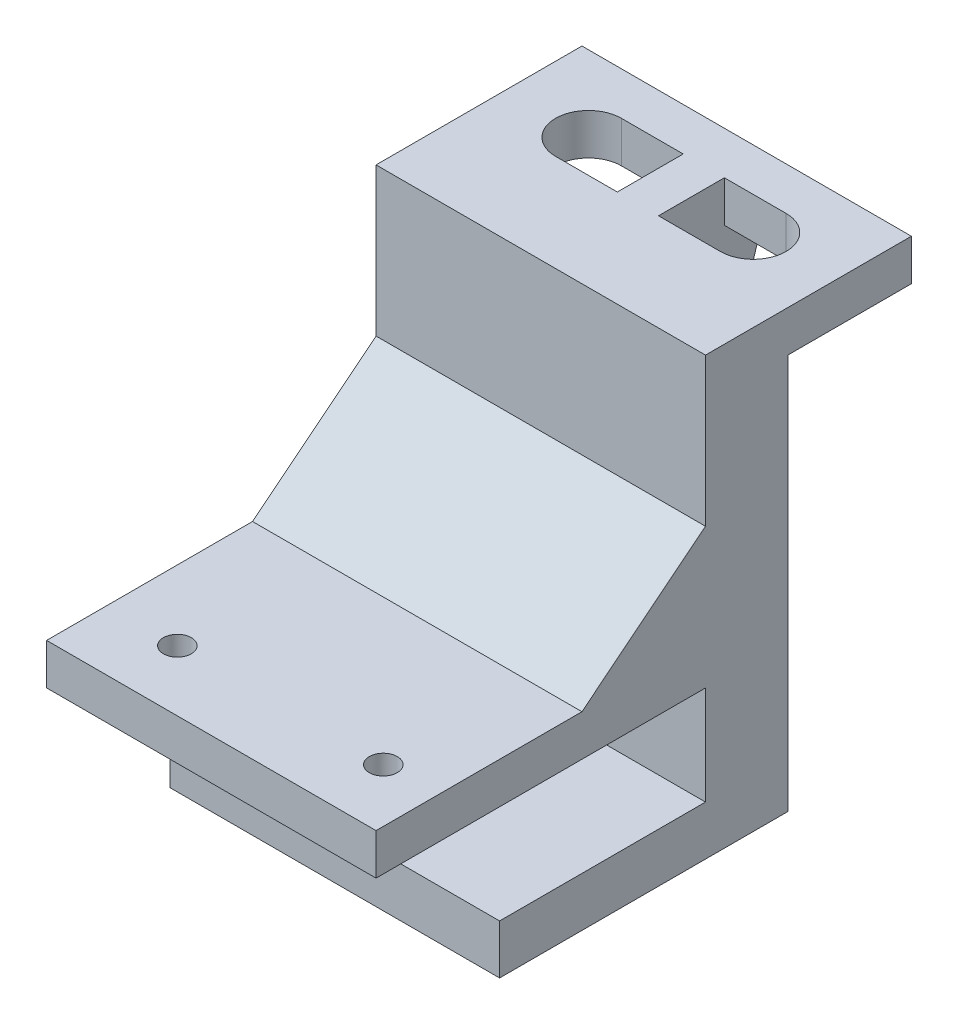
ISO-10303-21;
HEADER;
FILE_DESCRIPTION(('STEP AP214'),'2;1');
FILE_NAME('part.step','',(''),(''),'','','');
FILE_SCHEMA(('AUTOMOTIVE_DESIGN { 1 0 10303 214 1 1 1 1 }'));
ENDSEC;
DATA;
#1=APPLICATION_CONTEXT('core data for automotive mechanical design processes');
#2=APPLICATION_PROTOCOL_DEFINITION('international standard','automotive_design',2000,#1);
#3=PRODUCT_CONTEXT('',#1,'mechanical');
#4=PRODUCT('Part','Part','',(#3));
#5=PRODUCT_RELATED_PRODUCT_CATEGORY('part','',(#4));
#6=PRODUCT_DEFINITION_FORMATION('','',#4);
#7=PRODUCT_DEFINITION_CONTEXT('part definition',#1,'design');
#8=PRODUCT_DEFINITION('design','',#6,#7);
#9=PRODUCT_DEFINITION_SHAPE('','',#8);
#10=(LENGTH_UNIT() NAMED_UNIT(*) SI_UNIT(.MILLI.,.METRE.));
#11=(NAMED_UNIT(*) PLANE_ANGLE_UNIT() SI_UNIT($,.RADIAN.));
#12=(NAMED_UNIT(*) SI_UNIT($,.STERADIAN.) SOLID_ANGLE_UNIT());
#13=UNCERTAINTY_MEASURE_WITH_UNIT(LENGTH_MEASURE(1.E-05),#10,'distance_accuracy_value','');
#14=(GEOMETRIC_REPRESENTATION_CONTEXT(3) GLOBAL_UNCERTAINTY_ASSIGNED_CONTEXT((#13)) GLOBAL_UNIT_ASSIGNED_CONTEXT((#10,
#11,#12)) REPRESENTATION_CONTEXT('',''));
#15=CARTESIAN_POINT('',(0.,0.,0.));
#16=DIRECTION('',(0.,0.,1.));
#17=DIRECTION('',(1.,0.,0.));
#18=AXIS2_PLACEMENT_3D('',#15,#16,#17);
#19=CARTESIAN_POINT('',(-11.5,-10.,37.6238003373146));
#20=DIRECTION('',(0.,-1.,0.));
#21=DIRECTION('',(0.,0.,-1.));
#22=AXIS2_PLACEMENT_3D('',#19,#20,#21);
#23=CYLINDRICAL_SURFACE('',#22,1.7);
#24=CARTESIAN_POINT('',(-11.5,-30.,37.6238003373146));
#25=DIRECTION('',(0.,-1.,0.));
#26=DIRECTION('',(0.,0.,-1.));
#27=AXIS2_PLACEMENT_3D('',#24,#25,#26);
#28=CIRCLE('',#27,1.7);
#29=CARTESIAN_POINT('',(-11.5,-30.,35.9238003373146));
#30=VERTEX_POINT('',#29);
#31=EDGE_CURVE('E44',#30,#30,#28,.T.);
#32=ORIENTED_EDGE('',*,*,#31,.F.);
#33=EDGE_LOOP('',(#32));
#34=FACE_BOUND('',#33,.T.);
#35=CARTESIAN_POINT('',(-11.5,-35.,37.6238003373146));
#36=DIRECTION('',(0.,-1.,0.));
#37=DIRECTION('',(0.,0.,-1.));
#38=AXIS2_PLACEMENT_3D('',#35,#36,#37);
#39=CIRCLE('',#38,1.7);
#40=CARTESIAN_POINT('',(-11.5,-35.,35.9238003373146));
#41=VERTEX_POINT('',#40);
#42=EDGE_CURVE('E124',#41,#41,#39,.T.);
#43=ORIENTED_EDGE('',*,*,#42,.T.);
#44=EDGE_LOOP('',(#43));
#45=FACE_BOUND('',#44,.T.);
#46=ADVANCED_FACE('F16',(#34,#45),#23,.F.);
#47=CARTESIAN_POINT('',(13.5,-10.,37.6238003373146));
#48=DIRECTION('',(0.,-1.,0.));
#49=DIRECTION('',(0.,0.,-1.));
#50=AXIS2_PLACEMENT_3D('',#47,#48,#49);
#51=CYLINDRICAL_SURFACE('',#50,1.7);
#52=CARTESIAN_POINT('',(13.5,-30.,37.6238003373146));
#53=DIRECTION('',(0.,-1.,0.));
#54=DIRECTION('',(0.,0.,-1.));
#55=AXIS2_PLACEMENT_3D('',#52,#53,#54);
#56=CIRCLE('',#55,1.7);
#57=CARTESIAN_POINT('',(13.5,-30.,35.9238003373146));
#58=VERTEX_POINT('',#57);
#59=EDGE_CURVE('E34',#58,#58,#56,.T.);
#60=ORIENTED_EDGE('',*,*,#59,.F.);
#61=EDGE_LOOP('',(#60));
#62=FACE_BOUND('',#61,.T.);
#63=CARTESIAN_POINT('',(13.5,-35.,37.6238003373146));
#64=DIRECTION('',(0.,-1.,0.));
#65=DIRECTION('',(0.,0.,-1.));
#66=AXIS2_PLACEMENT_3D('',#63,#64,#65);
#67=CIRCLE('',#66,1.7);
#68=CARTESIAN_POINT('',(13.5,-35.,35.9238003373146));
#69=VERTEX_POINT('',#68);
#70=EDGE_CURVE('E127',#69,#69,#67,.T.);
#71=ORIENTED_EDGE('',*,*,#70,.T.);
#72=EDGE_LOOP('',(#71));
#73=FACE_BOUND('',#72,.T.);
#74=ADVANCED_FACE('F563',(#62,#73),#51,.F.);
#75=CARTESIAN_POINT('',(20.,-24.,12.5));
#76=DIRECTION('',(0.,0.78086880944303,0.624695047554424));
#77=DIRECTION('',(1.,0.,0.));
#78=AXIS2_PLACEMENT_3D('',#75,#76,#77);
#79=PLANE('',#78);
#80=DIRECTION('',(0.,0.624695047554424,-0.78086880944303));
#81=VECTOR('',#80,1.);
#82=CARTESIAN_POINT('',(-20.,-24.,12.5));
#83=LINE('',#82,#81);
#84=CARTESIAN_POINT('',(-20.,-30.,20.));
#85=VERTEX_POINT('',#84);
#86=CARTESIAN_POINT('',(-20.,-18.,5.));
#87=VERTEX_POINT('',#86);
#88=EDGE_CURVE('E175',#85,#87,#83,.T.);
#89=ORIENTED_EDGE('',*,*,#88,.F.);
#90=DIRECTION('',(-1.,0.,0.));
#91=VECTOR('',#90,1.);
#92=CARTESIAN_POINT('',(20.,-30.,20.));
#93=LINE('',#92,#91);
#94=CARTESIAN_POINT('',(20.,-30.,20.));
#95=VERTEX_POINT('',#94);
#96=EDGE_CURVE('E24',#95,#85,#93,.T.);
#97=ORIENTED_EDGE('',*,*,#96,.F.);
#98=DIRECTION('',(0.,0.624695047554424,-0.78086880944303));
#99=VECTOR('',#98,1.);
#100=CARTESIAN_POINT('',(20.,-24.,12.5));
#101=LINE('',#100,#99);
#102=CARTESIAN_POINT('',(20.,-18.,5.));
#103=VERTEX_POINT('',#102);
#104=EDGE_CURVE('E224',#95,#103,#101,.T.);
#105=ORIENTED_EDGE('',*,*,#104,.T.);
#106=DIRECTION('',(-1.,0.,0.));
#107=VECTOR('',#106,1.);
#108=CARTESIAN_POINT('',(20.,-18.,5.));
#109=LINE('',#108,#107);
#110=EDGE_CURVE('E222',#103,#87,#109,.T.);
#111=ORIENTED_EDGE('',*,*,#110,.T.);
#112=EDGE_LOOP('',(#89,#97,#105,#111));
#113=FACE_BOUND('',#112,.T.);
#114=ADVANCED_FACE('F220',(#113),#79,.T.);
#115=CARTESIAN_POINT('',(0.,-29.,45.));
#116=DIRECTION('',(0.,0.,1.));
#117=DIRECTION('',(1.,0.,0.));
#118=AXIS2_PLACEMENT_3D('',#115,#116,#117);
#119=PLANE('',#118);
#120=DIRECTION('',(-1.,0.,0.));
#121=VECTOR('',#120,1.);
#122=CARTESIAN_POINT('',(0.,-35.,45.));
#123=LINE('',#122,#121);
#124=CARTESIAN_POINT('',(20.,-35.,45.));
#125=VERTEX_POINT('',#124);
#126=CARTESIAN_POINT('',(-20.,-35.,45.));
#127=VERTEX_POINT('',#126);
#128=EDGE_CURVE('E135',#125,#127,#123,.T.);
#129=ORIENTED_EDGE('',*,*,#128,.F.);
#130=DIRECTION('',(0.,1.,0.));
#131=VECTOR('',#130,1.);
#132=CARTESIAN_POINT('',(20.,-53.,45.));
#133=LINE('',#132,#131);
#134=CARTESIAN_POINT('',(20.,-30.,45.));
#135=VERTEX_POINT('',#134);
#136=EDGE_CURVE('E437',#125,#135,#133,.T.);
#137=ORIENTED_EDGE('',*,*,#136,.T.);
#138=DIRECTION('',(-1.,0.,0.));
#139=VECTOR('',#138,1.);
#140=CARTESIAN_POINT('',(0.,-30.,45.));
#141=LINE('',#140,#139);
#142=CARTESIAN_POINT('',(-20.,-30.,45.));
#143=VERTEX_POINT('',#142);
#144=EDGE_CURVE('E10',#135,#143,#141,.T.);
#145=ORIENTED_EDGE('',*,*,#144,.T.);
#146=DIRECTION('',(0.,1.,0.));
#147=VECTOR('',#146,1.);
#148=CARTESIAN_POINT('',(-20.,-53.,45.));
#149=LINE('',#148,#147);
#150=EDGE_CURVE('E186',#127,#143,#149,.T.);
#151=ORIENTED_EDGE('',*,*,#150,.F.);
#152=EDGE_LOOP('',(#129,#137,#145,#151));
#153=FACE_BOUND('',#152,.T.);
#154=ADVANCED_FACE('F572',(#153),#119,.T.);
#155=CARTESIAN_POINT('',(0.,-30.,45.));
#156=DIRECTION('',(0.,-1.,0.));
#157=DIRECTION('',(0.,0.,-1.));
#158=AXIS2_PLACEMENT_3D('',#155,#156,#157);
#159=PLANE('',#158);
#160=DIRECTION('',(0.,0.,-1.));
#161=VECTOR('',#160,1.);
#162=CARTESIAN_POINT('',(20.,-30.,45.));
#163=LINE('',#162,#161);
#164=EDGE_CURVE('E207',#135,#95,#163,.T.);
#165=ORIENTED_EDGE('',*,*,#164,.T.);
#166=ORIENTED_EDGE('',*,*,#96,.T.);
#167=DIRECTION('',(0.,0.,-1.));
#168=VECTOR('',#167,1.);
#169=CARTESIAN_POINT('',(-20.,-30.,45.));
#170=LINE('',#169,#168);
#171=EDGE_CURVE('E138',#143,#85,#170,.T.);
#172=ORIENTED_EDGE('',*,*,#171,.F.);
#173=ORIENTED_EDGE('',*,*,#144,.F.);
#174=EDGE_LOOP('',(#165,#166,#172,#173));
#175=FACE_BOUND('',#174,.T.);
#176=ORIENTED_EDGE('',*,*,#59,.T.);
#177=EDGE_LOOP('',(#176));
#178=FACE_BOUND('',#177,.T.);
#179=ORIENTED_EDGE('',*,*,#31,.T.);
#180=EDGE_LOOP('',(#179));
#181=FACE_BOUND('',#180,.T.);
#182=ADVANCED_FACE('F205',(#175,#178,#181),#159,.F.);
#183=CARTESIAN_POINT('',(0.,-35.,45.));
#184=DIRECTION('',(0.,-1.,0.));
#185=DIRECTION('',(0.,0.,-1.));
#186=AXIS2_PLACEMENT_3D('',#183,#184,#185);
#187=PLANE('',#186);
#188=DIRECTION('',(-1.,0.,0.));
#189=VECTOR('',#188,1.);
#190=CARTESIAN_POINT('',(0.,-35.,5.));
#191=LINE('',#190,#189);
#192=CARTESIAN_POINT('',(20.,-35.,5.));
#193=VERTEX_POINT('',#192);
#194=CARTESIAN_POINT('',(-20.,-35.,5.));
#195=VERTEX_POINT('',#194);
#196=EDGE_CURVE('E398',#193,#195,#191,.T.);
#197=ORIENTED_EDGE('',*,*,#196,.F.);
#198=DIRECTION('',(0.,0.,-1.));
#199=VECTOR('',#198,1.);
#200=CARTESIAN_POINT('',(20.,-35.,45.));
#201=LINE('',#200,#199);
#202=EDGE_CURVE('E142',#125,#193,#201,.T.);
#203=ORIENTED_EDGE('',*,*,#202,.F.);
#204=ORIENTED_EDGE('',*,*,#128,.T.);
#205=DIRECTION('',(0.,0.,-1.));
#206=VECTOR('',#205,1.);
#207=CARTESIAN_POINT('',(-20.,-35.,45.));
#208=LINE('',#207,#206);
#209=EDGE_CURVE('E190',#127,#195,#208,.T.);
#210=ORIENTED_EDGE('',*,*,#209,.T.);
#211=EDGE_LOOP('',(#197,#203,#204,#210));
#212=FACE_BOUND('',#211,.T.);
#213=ORIENTED_EDGE('',*,*,#70,.F.);
#214=EDGE_LOOP('',(#213));
#215=FACE_BOUND('',#214,.T.);
#216=ORIENTED_EDGE('',*,*,#42,.F.);
#217=EDGE_LOOP('',(#216));
#218=FACE_BOUND('',#217,.T.);
#219=ADVANCED_FACE('F455',(#212,#215,#218),#187,.T.);
#220=CARTESIAN_POINT('',(22.5,-29.,-12.5));
#221=DIRECTION('',(0.,-0.298274993135947,-0.95447997803503));
#222=DIRECTION('',(0.,-0.95447997803503,0.298274993135947));
#223=AXIS2_PLACEMENT_3D('',#220,#221,#222);
#224=PLANE('',#223);
#225=DIRECTION('',(0.,-0.95447997803503,0.298274993135947));
#226=VECTOR('',#225,1.);
#227=CARTESIAN_POINT('',(2.5,-50.866590747331,-5.66669039145907));
#228=LINE('',#227,#226);
#229=CARTESIAN_POINT('',(2.5,-5.,-20.));
#230=VERTEX_POINT('',#229);
#231=CARTESIAN_POINT('',(2.5,-53.,-5.));
#232=VERTEX_POINT('',#231);
#233=EDGE_CURVE('E348',#230,#232,#228,.T.);
#234=ORIENTED_EDGE('',*,*,#233,.T.);
#235=DIRECTION('',(-1.,0.,0.));
#236=VECTOR('',#235,1.);
#237=CARTESIAN_POINT('',(22.5,-53.,-5.));
#238=LINE('',#237,#236);
#239=CARTESIAN_POINT('',(-2.5,-53.,-5.));
#240=VERTEX_POINT('',#239);
#241=EDGE_CURVE('E323',#232,#240,#238,.T.);
#242=ORIENTED_EDGE('',*,*,#241,.T.);
#243=DIRECTION('',(0.,-0.95447997803503,0.298274993135947));
#244=VECTOR('',#243,1.);
#245=CARTESIAN_POINT('',(-2.5,-29.,-12.5));
#246=LINE('',#245,#244);
#247=CARTESIAN_POINT('',(-2.5,-5.,-20.));
#248=VERTEX_POINT('',#247);
#249=EDGE_CURVE('E265',#248,#240,#246,.T.);
#250=ORIENTED_EDGE('',*,*,#249,.F.);
#251=DIRECTION('',(-1.,0.,0.));
#252=VECTOR('',#251,1.);
#253=CARTESIAN_POINT('',(22.5,-5.,-20.));
#254=LINE('',#253,#252);
#255=EDGE_CURVE('E246',#230,#248,#254,.T.);
#256=ORIENTED_EDGE('',*,*,#255,.F.);
#257=EDGE_LOOP('',(#234,#242,#250,#256));
#258=FACE_BOUND('',#257,.T.);
#259=ADVANCED_FACE('F580',(#258),#224,.T.);
#260=CARTESIAN_POINT('',(0.,-29.,30.));
#261=DIRECTION('',(0.,0.,1.));
#262=DIRECTION('',(1.,0.,0.));
#263=AXIS2_PLACEMENT_3D('',#260,#261,#262);
#264=PLANE('',#263);
#265=DIRECTION('',(0.,1.,0.));
#266=VECTOR('',#265,1.);
#267=CARTESIAN_POINT('',(20.,-53.,30.));
#268=LINE('',#267,#266);
#269=CARTESIAN_POINT('',(20.,-53.,30.));
#270=VERTEX_POINT('',#269);
#271=CARTESIAN_POINT('',(20.,-47.,30.));
#272=VERTEX_POINT('',#271);
#273=EDGE_CURVE('E147',#270,#272,#268,.T.);
#274=ORIENTED_EDGE('',*,*,#273,.T.);
#275=DIRECTION('',(-1.,0.,0.));
#276=VECTOR('',#275,1.);
#277=CARTESIAN_POINT('',(0.,-47.,30.));
#278=LINE('',#277,#276);
#279=CARTESIAN_POINT('',(-20.,-47.,30.));
#280=VERTEX_POINT('',#279);
#281=EDGE_CURVE('E128',#272,#280,#278,.T.);
#282=ORIENTED_EDGE('',*,*,#281,.T.);
#283=DIRECTION('',(0.,1.,0.));
#284=VECTOR('',#283,1.);
#285=CARTESIAN_POINT('',(-20.,-53.,30.));
#286=LINE('',#285,#284);
#287=CARTESIAN_POINT('',(-20.,-53.,30.));
#288=VERTEX_POINT('',#287);
#289=EDGE_CURVE('E176',#288,#280,#286,.T.);
#290=ORIENTED_EDGE('',*,*,#289,.F.);
#291=DIRECTION('',(-1.,0.,0.));
#292=VECTOR('',#291,1.);
#293=CARTESIAN_POINT('',(0.,-53.,30.));
#294=LINE('',#293,#292);
#295=EDGE_CURVE('E335',#270,#288,#294,.T.);
#296=ORIENTED_EDGE('',*,*,#295,.F.);
#297=EDGE_LOOP('',(#274,#282,#290,#296));
#298=FACE_BOUND('',#297,.T.);
#299=ADVANCED_FACE('F475',(#298),#264,.T.);
#300=CARTESIAN_POINT('',(0.,-47.,30.));
#301=DIRECTION('',(0.,-1.,0.));
#302=DIRECTION('',(0.,0.,-1.));
#303=AXIS2_PLACEMENT_3D('',#300,#301,#302);
#304=PLANE('',#303);
#305=DIRECTION('',(-1.,0.,0.));
#306=VECTOR('',#305,1.);
#307=CARTESIAN_POINT('',(0.,-47.,5.));
#308=LINE('',#307,#306);
#309=CARTESIAN_POINT('',(20.,-47.,5.));
#310=VERTEX_POINT('',#309);
#311=CARTESIAN_POINT('',(-20.,-47.,5.));
#312=VERTEX_POINT('',#311);
#313=EDGE_CURVE('E267',#310,#312,#308,.T.);
#314=ORIENTED_EDGE('',*,*,#313,.T.);
#315=DIRECTION('',(0.,0.,-1.));
#316=VECTOR('',#315,1.);
#317=CARTESIAN_POINT('',(-20.,-47.,30.));
#318=LINE('',#317,#316);
#319=EDGE_CURVE('E180',#280,#312,#318,.T.);
#320=ORIENTED_EDGE('',*,*,#319,.F.);
#321=ORIENTED_EDGE('',*,*,#281,.F.);
#322=DIRECTION('',(0.,0.,-1.));
#323=VECTOR('',#322,1.);
#324=CARTESIAN_POINT('',(20.,-47.,30.));
#325=LINE('',#324,#323);
#326=EDGE_CURVE('E144',#272,#310,#325,.T.);
#327=ORIENTED_EDGE('',*,*,#326,.T.);
#328=EDGE_LOOP('',(#314,#320,#321,#327));
#329=FACE_BOUND('',#328,.T.);
#330=ADVANCED_FACE('F463',(#329),#304,.F.);
#331=CARTESIAN_POINT('',(0.,-53.,-5.));
#332=DIRECTION('',(0.,0.,-1.));
#333=DIRECTION('',(0.,-1.,0.));
#334=AXIS2_PLACEMENT_3D('',#331,#332,#333);
#335=PLANE('',#334);
#336=DIRECTION('',(0.,1.,0.));
#337=VECTOR('',#336,1.);
#338=CARTESIAN_POINT('',(-2.5,-53.002,-5.));
#339=LINE('',#338,#337);
#340=CARTESIAN_POINT('',(-2.5,-5.,-5.));
#341=VERTEX_POINT('',#340);
#342=EDGE_CURVE('E276',#240,#341,#339,.T.);
#343=ORIENTED_EDGE('',*,*,#342,.F.);
#344=DIRECTION('',(-1.,0.,0.));
#345=VECTOR('',#344,1.);
#346=CARTESIAN_POINT('',(0.,-53.,-5.));
#347=LINE('',#346,#345);
#348=CARTESIAN_POINT('',(-20.,-53.,-5.));
#349=VERTEX_POINT('',#348);
#350=EDGE_CURVE('E313',#240,#349,#347,.T.);
#351=ORIENTED_EDGE('',*,*,#350,.T.);
#352=DIRECTION('',(0.,1.,0.));
#353=VECTOR('',#352,1.);
#354=CARTESIAN_POINT('',(-20.,-53.,-5.));
#355=LINE('',#354,#353);
#356=CARTESIAN_POINT('',(-20.,-5.,-5.));
#357=VERTEX_POINT('',#356);
#358=EDGE_CURVE('E181',#349,#357,#355,.T.);
#359=ORIENTED_EDGE('',*,*,#358,.T.);
#360=DIRECTION('',(-1.,0.,0.));
#361=VECTOR('',#360,1.);
#362=CARTESIAN_POINT('',(0.,-5.,-5.));
#363=LINE('',#362,#361);
#364=EDGE_CURVE('E271',#341,#357,#363,.T.);
#365=ORIENTED_EDGE('',*,*,#364,.F.);
#366=EDGE_LOOP('',(#343,#351,#359,#365));
#367=FACE_BOUND('',#366,.T.);
#368=ADVANCED_FACE('F548',(#367),#335,.T.);
#369=CARTESIAN_POINT('',(0.,0.,0.));
#370=DIRECTION('',(0.,-1.,0.));
#371=DIRECTION('',(0.,0.,-1.));
#372=AXIS2_PLACEMENT_3D('',#369,#370,#371);
#373=PLANE('',#372);
#374=DIRECTION('',(0.,0.,1.));
#375=VECTOR('',#374,1.);
#376=CARTESIAN_POINT('',(-20.,0.,0.));
#377=LINE('',#376,#375);
#378=CARTESIAN_POINT('',(-20.,0.,-20.));
#379=VERTEX_POINT('',#378);
#380=CARTESIAN_POINT('',(-20.,0.,5.));
#381=VERTEX_POINT('',#380);
#382=EDGE_CURVE('E185',#379,#381,#377,.T.);
#383=ORIENTED_EDGE('',*,*,#382,.T.);
#384=DIRECTION('',(1.,0.,0.));
#385=VECTOR('',#384,1.);
#386=CARTESIAN_POINT('',(0.,0.,5.));
#387=LINE('',#386,#385);
#388=CARTESIAN_POINT('',(20.,0.,5.));
#389=VERTEX_POINT('',#388);
#390=EDGE_CURVE('E237',#381,#389,#387,.T.);
#391=ORIENTED_EDGE('',*,*,#390,.T.);
#392=DIRECTION('',(0.,0.,1.));
#393=VECTOR('',#392,1.);
#394=CARTESIAN_POINT('',(20.,0.,0.));
#395=LINE('',#394,#393);
#396=CARTESIAN_POINT('',(20.,0.,-20.));
#397=VERTEX_POINT('',#396);
#398=EDGE_CURVE('E151',#397,#389,#395,.T.);
#399=ORIENTED_EDGE('',*,*,#398,.F.);
#400=DIRECTION('',(-1.,0.,0.));
#401=VECTOR('',#400,1.);
#402=CARTESIAN_POINT('',(0.,0.,-20.));
#403=LINE('',#402,#401);
#404=EDGE_CURVE('E302',#397,#379,#403,.T.);
#405=ORIENTED_EDGE('',*,*,#404,.T.);
#406=EDGE_LOOP('',(#383,#391,#399,#405));
#407=FACE_BOUND('',#406,.T.);
#408=DIRECTION('',(1.,0.,0.));
#409=VECTOR('',#408,1.);
#410=CARTESIAN_POINT('',(0.,0.,-14.7933925464749));
#411=LINE('',#410,#409);
#412=CARTESIAN_POINT('',(-10.,0.,-14.7933925464749));
#413=VERTEX_POINT('',#412);
#414=CARTESIAN_POINT('',(-2.5,0.,-14.7933925464749));
#415=VERTEX_POINT('',#414);
#416=EDGE_CURVE('E171',#413,#415,#411,.T.);
#417=ORIENTED_EDGE('',*,*,#416,.T.);
#418=DIRECTION('',(0.,0.,1.));
#419=VECTOR('',#418,1.);
#420=CARTESIAN_POINT('',(-2.5,0.,-12.5));
#421=LINE('',#420,#419);
#422=CARTESIAN_POINT('',(-2.5,0.,-6.79339254647493));
#423=VERTEX_POINT('',#422);
#424=EDGE_CURVE('E241',#415,#423,#421,.T.);
#425=ORIENTED_EDGE('',*,*,#424,.T.);
#426=DIRECTION('',(1.,0.,0.));
#427=VECTOR('',#426,1.);
#428=CARTESIAN_POINT('',(0.,0.,-6.79339254647493));
#429=LINE('',#428,#427);
#430=CARTESIAN_POINT('',(-10.,0.,-6.79339254647493));
#431=VERTEX_POINT('',#430);
#432=EDGE_CURVE('E164',#431,#423,#429,.T.);
#433=ORIENTED_EDGE('',*,*,#432,.F.);
#434=CARTESIAN_POINT('',(-10.,0.,-10.7933925464749));
#435=DIRECTION('',(0.,-1.,0.));
#436=DIRECTION('',(0.,0.,-1.));
#437=AXIS2_PLACEMENT_3D('',#434,#435,#436);
#438=CIRCLE('',#437,4.);
#439=EDGE_CURVE('E157',#431,#413,#438,.T.);
#440=ORIENTED_EDGE('',*,*,#439,.T.);
#441=EDGE_LOOP('',(#417,#425,#433,#440));
#442=FACE_BOUND('',#441,.T.);
#443=DIRECTION('',(0.,0.,1.));
#444=VECTOR('',#443,1.);
#445=CARTESIAN_POINT('',(2.5,0.,-12.5));
#446=LINE('',#445,#444);
#447=CARTESIAN_POINT('',(2.5,0.,-14.7933925464749));
#448=VERTEX_POINT('',#447);
#449=CARTESIAN_POINT('',(2.5,0.,-6.79339254647493));
#450=VERTEX_POINT('',#449);
#451=EDGE_CURVE('E314',#448,#450,#446,.T.);
#452=ORIENTED_EDGE('',*,*,#451,.F.);
#453=DIRECTION('',(1.,0.,0.));
#454=VECTOR('',#453,1.);
#455=CARTESIAN_POINT('',(0.,0.,-14.7933925464749));
#456=LINE('',#455,#454);
#457=CARTESIAN_POINT('',(10.,0.,-14.7933925464749));
#458=VERTEX_POINT('',#457);
#459=EDGE_CURVE('E394',#448,#458,#456,.T.);
#460=ORIENTED_EDGE('',*,*,#459,.T.);
#461=CARTESIAN_POINT('',(10.,0.,-10.7933925464749));
#462=DIRECTION('',(0.,-1.,0.));
#463=DIRECTION('',(0.,0.,-1.));
#464=AXIS2_PLACEMENT_3D('',#461,#462,#463);
#465=CIRCLE('',#464,4.);
#466=CARTESIAN_POINT('',(10.,0.,-6.79339254647493));
#467=VERTEX_POINT('',#466);
#468=EDGE_CURVE('E168',#458,#467,#465,.T.);
#469=ORIENTED_EDGE('',*,*,#468,.T.);
#470=DIRECTION('',(1.,0.,0.));
#471=VECTOR('',#470,1.);
#472=CARTESIAN_POINT('',(0.,0.,-6.79339254647493));
#473=LINE('',#472,#471);
#474=EDGE_CURVE('E366',#450,#467,#473,.T.);
#475=ORIENTED_EDGE('',*,*,#474,.F.);
#476=EDGE_LOOP('',(#452,#460,#469,#475));
#477=FACE_BOUND('',#476,.T.);
#478=ADVANCED_FACE('F546',(#407,#442,#477),#373,.F.);
#479=CARTESIAN_POINT('',(-20.,-5.,0.));
#480=DIRECTION('',(-1.,0.,0.));
#481=DIRECTION('',(0.,0.,1.));
#482=AXIS2_PLACEMENT_3D('',#479,#480,#481);
#483=PLANE('',#482);
#484=ORIENTED_EDGE('',*,*,#88,.T.);
#485=DIRECTION('',(0.,1.,0.));
#486=VECTOR('',#485,1.);
#487=CARTESIAN_POINT('',(-20.,-53.,5.));
#488=LINE('',#487,#486);
#489=EDGE_CURVE('E257',#87,#381,#488,.T.);
#490=ORIENTED_EDGE('',*,*,#489,.T.);
#491=ORIENTED_EDGE('',*,*,#382,.F.);
#492=DIRECTION('',(0.,1.,0.));
#493=VECTOR('',#492,1.);
#494=CARTESIAN_POINT('',(-20.,-5.,-20.));
#495=LINE('',#494,#493);
#496=CARTESIAN_POINT('',(-20.,-5.,-20.));
#497=VERTEX_POINT('',#496);
#498=EDGE_CURVE('E301',#497,#379,#495,.T.);
#499=ORIENTED_EDGE('',*,*,#498,.F.);
#500=DIRECTION('',(0.,0.,1.));
#501=VECTOR('',#500,1.);
#502=CARTESIAN_POINT('',(-20.,-5.,0.));
#503=LINE('',#502,#501);
#504=EDGE_CURVE('E419',#497,#357,#503,.T.);
#505=ORIENTED_EDGE('',*,*,#504,.T.);
#506=ORIENTED_EDGE('',*,*,#358,.F.);
#507=DIRECTION('',(0.,0.,1.));
#508=VECTOR('',#507,1.);
#509=CARTESIAN_POINT('',(-20.,-53.,0.));
#510=LINE('',#509,#508);
#511=EDGE_CURVE('E339',#349,#288,#510,.T.);
#512=ORIENTED_EDGE('',*,*,#511,.T.);
#513=ORIENTED_EDGE('',*,*,#289,.T.);
#514=ORIENTED_EDGE('',*,*,#319,.T.);
#515=DIRECTION('',(0.,1.,0.));
#516=VECTOR('',#515,1.);
#517=CARTESIAN_POINT('',(-20.,-53.,5.));
#518=LINE('',#517,#516);
#519=EDGE_CURVE('E272',#312,#195,#518,.T.);
#520=ORIENTED_EDGE('',*,*,#519,.T.);
#521=ORIENTED_EDGE('',*,*,#209,.F.);
#522=ORIENTED_EDGE('',*,*,#150,.T.);
#523=ORIENTED_EDGE('',*,*,#171,.T.);
#524=EDGE_LOOP('',(#484,#490,#491,#499,#505,#506,#512,#513,#514,#520,#521,#522,#523));
#525=FACE_BOUND('',#524,.T.);
#526=ADVANCED_FACE('F213',(#525),#483,.T.);
#527=CARTESIAN_POINT('',(0.,-5.,-14.7933925464749));
#528=DIRECTION('',(0.,0.,1.));
#529=DIRECTION('',(1.,0.,0.));
#530=AXIS2_PLACEMENT_3D('',#527,#528,#529);
#531=PLANE('',#530);
#532=DIRECTION('',(0.,-1.,0.));
#533=VECTOR('',#532,1.);
#534=CARTESIAN_POINT('',(-2.5,-5.,-14.7933925464749));
#535=LINE('',#534,#533);
#536=CARTESIAN_POINT('',(-2.5,-5.,-14.7933925464749));
#537=VERTEX_POINT('',#536);
#538=EDGE_CURVE('E247',#415,#537,#535,.T.);
#539=ORIENTED_EDGE('',*,*,#538,.F.);
#540=ORIENTED_EDGE('',*,*,#416,.F.);
#541=DIRECTION('',(0.,1.,0.));
#542=VECTOR('',#541,1.);
#543=CARTESIAN_POINT('',(-10.,-5.,-14.7933925464749));
#544=LINE('',#543,#542);
#545=CARTESIAN_POINT('',(-10.,-5.,-14.7933925464749));
#546=VERTEX_POINT('',#545);
#547=EDGE_CURVE('E156',#546,#413,#544,.T.);
#548=ORIENTED_EDGE('',*,*,#547,.F.);
#549=DIRECTION('',(1.,0.,0.));
#550=VECTOR('',#549,1.);
#551=CARTESIAN_POINT('',(0.,-5.,-14.7933925464749));
#552=LINE('',#551,#550);
#553=EDGE_CURVE('E420',#546,#537,#552,.T.);
#554=ORIENTED_EDGE('',*,*,#553,.T.);
#555=EDGE_LOOP('',(#539,#540,#548,#554));
#556=FACE_BOUND('',#555,.T.);
#557=ADVANCED_FACE('F556',(#556),#531,.T.);
#558=CARTESIAN_POINT('',(10.,-5.,-10.7933925464749));
#559=DIRECTION('',(0.,1.,0.));
#560=DIRECTION('',(0.,0.,1.));
#561=AXIS2_PLACEMENT_3D('',#558,#559,#560);
#562=CYLINDRICAL_SURFACE('',#561,4.);
#563=ORIENTED_EDGE('',*,*,#468,.F.);
#564=DIRECTION('',(0.,1.,0.));
#565=VECTOR('',#564,1.);
#566=CARTESIAN_POINT('',(10.,-5.,-14.7933925464749));
#567=LINE('',#566,#565);
#568=CARTESIAN_POINT('',(10.,-5.,-14.7933925464749));
#569=VERTEX_POINT('',#568);
#570=EDGE_CURVE('E402',#569,#458,#567,.T.);
#571=ORIENTED_EDGE('',*,*,#570,.F.);
#572=CARTESIAN_POINT('',(10.,-5.,-10.7933925464749));
#573=DIRECTION('',(0.,-1.,0.));
#574=DIRECTION('',(0.,0.,-1.));
#575=AXIS2_PLACEMENT_3D('',#572,#573,#574);
#576=CIRCLE('',#575,4.);
#577=CARTESIAN_POINT('',(10.,-5.,-6.79339254647493));
#578=VERTEX_POINT('',#577);
#579=EDGE_CURVE('E344',#569,#578,#576,.T.);
#580=ORIENTED_EDGE('',*,*,#579,.T.);
#581=DIRECTION('',(0.,1.,0.));
#582=VECTOR('',#581,1.);
#583=CARTESIAN_POINT('',(10.,-5.,-6.79339254647493));
#584=LINE('',#583,#582);
#585=EDGE_CURVE('E370',#578,#467,#584,.T.);
#586=ORIENTED_EDGE('',*,*,#585,.T.);
#587=EDGE_LOOP('',(#563,#571,#580,#586));
#588=FACE_BOUND('',#587,.T.);
#589=ADVANCED_FACE('F533',(#588),#562,.F.);
#590=CARTESIAN_POINT('',(0.,-5.,-6.79339254647493));
#591=DIRECTION('',(0.,0.,1.));
#592=DIRECTION('',(1.,0.,0.));
#593=AXIS2_PLACEMENT_3D('',#590,#591,#592);
#594=PLANE('',#593);
#595=ORIENTED_EDGE('',*,*,#432,.T.);
#596=DIRECTION('',(0.,-1.,0.));
#597=VECTOR('',#596,1.);
#598=CARTESIAN_POINT('',(-2.5,-5.,-6.79339254647493));
#599=LINE('',#598,#597);
#600=CARTESIAN_POINT('',(-2.5,-5.,-6.79339254647493));
#601=VERTEX_POINT('',#600);
#602=EDGE_CURVE('E288',#423,#601,#599,.T.);
#603=ORIENTED_EDGE('',*,*,#602,.T.);
#604=DIRECTION('',(1.,0.,0.));
#605=VECTOR('',#604,1.);
#606=CARTESIAN_POINT('',(0.,-5.,-6.79339254647493));
#607=LINE('',#606,#605);
#608=CARTESIAN_POINT('',(-10.,-5.,-6.79339254647493));
#609=VERTEX_POINT('',#608);
#610=EDGE_CURVE('E428',#609,#601,#607,.T.);
#611=ORIENTED_EDGE('',*,*,#610,.F.);
#612=DIRECTION('',(0.,1.,0.));
#613=VECTOR('',#612,1.);
#614=CARTESIAN_POINT('',(-10.,-5.,-6.79339254647493));
#615=LINE('',#614,#613);
#616=EDGE_CURVE('E152',#609,#431,#615,.T.);
#617=ORIENTED_EDGE('',*,*,#616,.T.);
#618=EDGE_LOOP('',(#595,#603,#611,#617));
#619=FACE_BOUND('',#618,.T.);
#620=ADVANCED_FACE('F637',(#619),#594,.F.);
#621=CARTESIAN_POINT('',(-10.,-5.,-10.7933925464749));
#622=DIRECTION('',(0.,1.,0.));
#623=DIRECTION('',(0.,0.,1.));
#624=AXIS2_PLACEMENT_3D('',#621,#622,#623);
#625=CYLINDRICAL_SURFACE('',#624,4.);
#626=ORIENTED_EDGE('',*,*,#439,.F.);
#627=ORIENTED_EDGE('',*,*,#616,.F.);
#628=CARTESIAN_POINT('',(-10.,-5.,-10.7933925464749));
#629=DIRECTION('',(0.,-1.,0.));
#630=DIRECTION('',(0.,0.,-1.));
#631=AXIS2_PLACEMENT_3D('',#628,#629,#630);
#632=CIRCLE('',#631,4.);
#633=EDGE_CURVE('E424',#609,#546,#632,.T.);
#634=ORIENTED_EDGE('',*,*,#633,.T.);
#635=ORIENTED_EDGE('',*,*,#547,.T.);
#636=EDGE_LOOP('',(#626,#627,#634,#635));
#637=FACE_BOUND('',#636,.T.);
#638=ADVANCED_FACE('F648',(#637),#625,.F.);
#639=CARTESIAN_POINT('',(20.,-5.,0.));
#640=DIRECTION('',(-1.,0.,0.));
#641=DIRECTION('',(0.,0.,1.));
#642=AXIS2_PLACEMENT_3D('',#639,#640,#641);
#643=PLANE('',#642);
#644=DIRECTION('',(0.,1.,0.));
#645=VECTOR('',#644,1.);
#646=CARTESIAN_POINT('',(20.,-53.,5.));
#647=LINE('',#646,#645);
#648=EDGE_CURVE('E232',#103,#389,#647,.T.);
#649=ORIENTED_EDGE('',*,*,#648,.F.);
#650=ORIENTED_EDGE('',*,*,#104,.F.);
#651=ORIENTED_EDGE('',*,*,#164,.F.);
#652=ORIENTED_EDGE('',*,*,#136,.F.);
#653=ORIENTED_EDGE('',*,*,#202,.T.);
#654=DIRECTION('',(0.,1.,0.));
#655=VECTOR('',#654,1.);
#656=CARTESIAN_POINT('',(20.,-53.,5.));
#657=LINE('',#656,#655);
#658=EDGE_CURVE('E406',#310,#193,#657,.T.);
#659=ORIENTED_EDGE('',*,*,#658,.F.);
#660=ORIENTED_EDGE('',*,*,#326,.F.);
#661=ORIENTED_EDGE('',*,*,#273,.F.);
#662=DIRECTION('',(0.,0.,1.));
#663=VECTOR('',#662,1.);
#664=CARTESIAN_POINT('',(20.,-53.,0.));
#665=LINE('',#664,#663);
#666=CARTESIAN_POINT('',(20.,-53.,-5.));
#667=VERTEX_POINT('',#666);
#668=EDGE_CURVE('E331',#667,#270,#665,.T.);
#669=ORIENTED_EDGE('',*,*,#668,.F.);
#670=DIRECTION('',(0.,1.,0.));
#671=VECTOR('',#670,1.);
#672=CARTESIAN_POINT('',(20.,-53.,-5.));
#673=LINE('',#672,#671);
#674=CARTESIAN_POINT('',(20.,-5.,-5.));
#675=VERTEX_POINT('',#674);
#676=EDGE_CURVE('E296',#667,#675,#673,.T.);
#677=ORIENTED_EDGE('',*,*,#676,.T.);
#678=DIRECTION('',(0.,0.,1.));
#679=VECTOR('',#678,1.);
#680=CARTESIAN_POINT('',(20.,-5.,0.));
#681=LINE('',#680,#679);
#682=CARTESIAN_POINT('',(20.,-5.,-20.));
#683=VERTEX_POINT('',#682);
#684=EDGE_CURVE('E371',#683,#675,#681,.T.);
#685=ORIENTED_EDGE('',*,*,#684,.F.);
#686=DIRECTION('',(0.,1.,0.));
#687=VECTOR('',#686,1.);
#688=CARTESIAN_POINT('',(20.,-5.,-20.));
#689=LINE('',#688,#687);
#690=EDGE_CURVE('E306',#683,#397,#689,.T.);
#691=ORIENTED_EDGE('',*,*,#690,.T.);
#692=ORIENTED_EDGE('',*,*,#398,.T.);
#693=EDGE_LOOP('',(#649,#650,#651,#652,#653,#659,#660,#661,#669,#677,#685,#691,#692));
#694=FACE_BOUND('',#693,.T.);
#695=ADVANCED_FACE('F452',(#694),#643,.F.);
#696=CARTESIAN_POINT('',(0.,-5.,0.));
#697=DIRECTION('',(0.,-1.,0.));
#698=DIRECTION('',(0.,0.,-1.));
#699=AXIS2_PLACEMENT_3D('',#696,#697,#698);
#700=PLANE('',#699);
#701=DIRECTION('',(0.,0.,-1.));
#702=VECTOR('',#701,1.);
#703=CARTESIAN_POINT('',(-2.5,-5.,0.));
#704=LINE('',#703,#702);
#705=EDGE_CURVE('E280',#341,#601,#704,.T.);
#706=ORIENTED_EDGE('',*,*,#705,.F.);
#707=ORIENTED_EDGE('',*,*,#364,.T.);
#708=ORIENTED_EDGE('',*,*,#504,.F.);
#709=DIRECTION('',(-1.,0.,0.));
#710=VECTOR('',#709,1.);
#711=CARTESIAN_POINT('',(0.,-5.,-20.));
#712=LINE('',#711,#710);
#713=EDGE_CURVE('E284',#248,#497,#712,.T.);
#714=ORIENTED_EDGE('',*,*,#713,.F.);
#715=DIRECTION('',(0.,0.,-1.));
#716=VECTOR('',#715,1.);
#717=CARTESIAN_POINT('',(-2.5,-5.,0.));
#718=LINE('',#717,#716);
#719=EDGE_CURVE('E262',#537,#248,#718,.T.);
#720=ORIENTED_EDGE('',*,*,#719,.F.);
#721=ORIENTED_EDGE('',*,*,#553,.F.);
#722=ORIENTED_EDGE('',*,*,#633,.F.);
#723=ORIENTED_EDGE('',*,*,#610,.T.);
#724=EDGE_LOOP('',(#706,#707,#708,#714,#720,#721,#722,#723));
#725=FACE_BOUND('',#724,.T.);
#726=ADVANCED_FACE('F671',(#725),#700,.T.);
#727=CARTESIAN_POINT('',(0.,-53.,5.));
#728=DIRECTION('',(0.,0.,-1.));
#729=DIRECTION('',(0.,-1.,0.));
#730=AXIS2_PLACEMENT_3D('',#727,#728,#729);
#731=PLANE('',#730);
#732=ORIENTED_EDGE('',*,*,#658,.T.);
#733=ORIENTED_EDGE('',*,*,#196,.T.);
#734=ORIENTED_EDGE('',*,*,#519,.F.);
#735=ORIENTED_EDGE('',*,*,#313,.F.);
#736=EDGE_LOOP('',(#732,#733,#734,#735));
#737=FACE_BOUND('',#736,.T.);
#738=ADVANCED_FACE('F460',(#737),#731,.F.);
#739=CARTESIAN_POINT('',(0.,-5.,-14.7933925464749));
#740=DIRECTION('',(0.,0.,1.));
#741=DIRECTION('',(1.,0.,0.));
#742=AXIS2_PLACEMENT_3D('',#739,#740,#741);
#743=PLANE('',#742);
#744=ORIENTED_EDGE('',*,*,#459,.F.);
#745=DIRECTION('',(0.,-1.,0.));
#746=VECTOR('',#745,1.);
#747=CARTESIAN_POINT('',(2.5,-5.,-14.7933925464749));
#748=LINE('',#747,#746);
#749=CARTESIAN_POINT('',(2.5,-5.,-14.7933925464749));
#750=VERTEX_POINT('',#749);
#751=EDGE_CURVE('E319',#448,#750,#748,.T.);
#752=ORIENTED_EDGE('',*,*,#751,.T.);
#753=DIRECTION('',(1.,0.,0.));
#754=VECTOR('',#753,1.);
#755=CARTESIAN_POINT('',(0.,-5.,-14.7933925464749));
#756=LINE('',#755,#754);
#757=EDGE_CURVE('E384',#750,#569,#756,.T.);
#758=ORIENTED_EDGE('',*,*,#757,.T.);
#759=ORIENTED_EDGE('',*,*,#570,.T.);
#760=EDGE_LOOP('',(#744,#752,#758,#759));
#761=FACE_BOUND('',#760,.T.);
#762=ADVANCED_FACE('F536',(#761),#743,.T.);
#763=CARTESIAN_POINT('',(0.,-5.,-6.79339254647493));
#764=DIRECTION('',(0.,0.,1.));
#765=DIRECTION('',(1.,0.,0.));
#766=AXIS2_PLACEMENT_3D('',#763,#764,#765);
#767=PLANE('',#766);
#768=DIRECTION('',(0.,-1.,0.));
#769=VECTOR('',#768,1.);
#770=CARTESIAN_POINT('',(2.5,-5.,-6.79339254647493));
#771=LINE('',#770,#769);
#772=CARTESIAN_POINT('',(2.5,-5.,-6.79339254647493));
#773=VERTEX_POINT('',#772);
#774=EDGE_CURVE('E318',#450,#773,#771,.T.);
#775=ORIENTED_EDGE('',*,*,#774,.F.);
#776=ORIENTED_EDGE('',*,*,#474,.T.);
#777=ORIENTED_EDGE('',*,*,#585,.F.);
#778=DIRECTION('',(1.,0.,0.));
#779=VECTOR('',#778,1.);
#780=CARTESIAN_POINT('',(0.,-5.,-6.79339254647493));
#781=LINE('',#780,#779);
#782=EDGE_CURVE('E340',#773,#578,#781,.T.);
#783=ORIENTED_EDGE('',*,*,#782,.F.);
#784=EDGE_LOOP('',(#775,#776,#777,#783));
#785=FACE_BOUND('',#784,.T.);
#786=ADVANCED_FACE('F542',(#785),#767,.F.);
#787=CARTESIAN_POINT('',(0.,-5.,0.));
#788=DIRECTION('',(0.,-1.,0.));
#789=DIRECTION('',(0.,0.,-1.));
#790=AXIS2_PLACEMENT_3D('',#787,#788,#789);
#791=PLANE('',#790);
#792=DIRECTION('',(-1.,0.,0.));
#793=VECTOR('',#792,1.);
#794=CARTESIAN_POINT('',(0.,-5.,-5.));
#795=LINE('',#794,#793);
#796=CARTESIAN_POINT('',(2.5,-5.,-5.));
#797=VERTEX_POINT('',#796);
#798=EDGE_CURVE('E292',#675,#797,#795,.T.);
#799=ORIENTED_EDGE('',*,*,#798,.T.);
#800=DIRECTION('',(0.,0.,-1.));
#801=VECTOR('',#800,1.);
#802=CARTESIAN_POINT('',(2.5,-5.,0.));
#803=LINE('',#802,#801);
#804=EDGE_CURVE('E365',#797,#773,#803,.T.);
#805=ORIENTED_EDGE('',*,*,#804,.T.);
#806=ORIENTED_EDGE('',*,*,#782,.T.);
#807=ORIENTED_EDGE('',*,*,#579,.F.);
#808=ORIENTED_EDGE('',*,*,#757,.F.);
#809=DIRECTION('',(0.,0.,-1.));
#810=VECTOR('',#809,1.);
#811=CARTESIAN_POINT('',(2.5,-5.,0.));
#812=LINE('',#811,#810);
#813=EDGE_CURVE('E352',#750,#230,#812,.T.);
#814=ORIENTED_EDGE('',*,*,#813,.T.);
#815=DIRECTION('',(-1.,0.,0.));
#816=VECTOR('',#815,1.);
#817=CARTESIAN_POINT('',(0.,-5.,-20.));
#818=LINE('',#817,#816);
#819=EDGE_CURVE('E243',#683,#230,#818,.T.);
#820=ORIENTED_EDGE('',*,*,#819,.F.);
#821=ORIENTED_EDGE('',*,*,#684,.T.);
#822=EDGE_LOOP('',(#799,#805,#806,#807,#808,#814,#820,#821));
#823=FACE_BOUND('',#822,.T.);
#824=ADVANCED_FACE('F540',(#823),#791,.T.);
#825=CARTESIAN_POINT('',(0.,-53.,-5.));
#826=DIRECTION('',(0.,0.,-1.));
#827=DIRECTION('',(0.,-1.,0.));
#828=AXIS2_PLACEMENT_3D('',#825,#826,#827);
#829=PLANE('',#828);
#830=DIRECTION('',(-1.,0.,0.));
#831=VECTOR('',#830,1.);
#832=CARTESIAN_POINT('',(0.,-53.,-5.));
#833=LINE('',#832,#831);
#834=EDGE_CURVE('E327',#667,#232,#833,.T.);
#835=ORIENTED_EDGE('',*,*,#834,.T.);
#836=DIRECTION('',(0.,1.,0.));
#837=VECTOR('',#836,1.);
#838=CARTESIAN_POINT('',(2.5,-53.002,-5.));
#839=LINE('',#838,#837);
#840=EDGE_CURVE('E297',#232,#797,#839,.T.);
#841=ORIENTED_EDGE('',*,*,#840,.T.);
#842=ORIENTED_EDGE('',*,*,#798,.F.);
#843=ORIENTED_EDGE('',*,*,#676,.F.);
#844=EDGE_LOOP('',(#835,#841,#842,#843));
#845=FACE_BOUND('',#844,.T.);
#846=ADVANCED_FACE('F486',(#845),#829,.T.);
#847=CARTESIAN_POINT('',(2.5,-53.002,-12.5));
#848=DIRECTION('',(-1.,0.,0.));
#849=DIRECTION('',(0.,0.,1.));
#850=AXIS2_PLACEMENT_3D('',#847,#848,#849);
#851=PLANE('',#850);
#852=ORIENTED_EDGE('',*,*,#233,.F.);
#853=ORIENTED_EDGE('',*,*,#813,.F.);
#854=ORIENTED_EDGE('',*,*,#751,.F.);
#855=ORIENTED_EDGE('',*,*,#451,.T.);
#856=ORIENTED_EDGE('',*,*,#774,.T.);
#857=ORIENTED_EDGE('',*,*,#804,.F.);
#858=ORIENTED_EDGE('',*,*,#840,.F.);
#859=EDGE_LOOP('',(#852,#853,#854,#855,#856,#857,#858));
#860=FACE_BOUND('',#859,.T.);
#861=ADVANCED_FACE('F544',(#860),#851,.F.);
#862=CARTESIAN_POINT('',(0.,-53.,0.));
#863=DIRECTION('',(0.,-1.,0.));
#864=DIRECTION('',(0.,0.,-1.));
#865=AXIS2_PLACEMENT_3D('',#862,#863,#864);
#866=PLANE('',#865);
#867=ORIENTED_EDGE('',*,*,#350,.F.);
#868=ORIENTED_EDGE('',*,*,#241,.F.);
#869=ORIENTED_EDGE('',*,*,#834,.F.);
#870=ORIENTED_EDGE('',*,*,#668,.T.);
#871=ORIENTED_EDGE('',*,*,#295,.T.);
#872=ORIENTED_EDGE('',*,*,#511,.F.);
#873=EDGE_LOOP('',(#867,#868,#869,#870,#871,#872));
#874=FACE_BOUND('',#873,.T.);
#875=ADVANCED_FACE('F479',(#874),#866,.T.);
#876=CARTESIAN_POINT('',(0.,-5.,-20.));
#877=DIRECTION('',(0.,0.,-1.));
#878=DIRECTION('',(0.,-1.,0.));
#879=AXIS2_PLACEMENT_3D('',#876,#877,#878);
#880=PLANE('',#879);
#881=ORIENTED_EDGE('',*,*,#819,.T.);
#882=ORIENTED_EDGE('',*,*,#255,.T.);
#883=ORIENTED_EDGE('',*,*,#713,.T.);
#884=ORIENTED_EDGE('',*,*,#498,.T.);
#885=ORIENTED_EDGE('',*,*,#404,.F.);
#886=ORIENTED_EDGE('',*,*,#690,.F.);
#887=EDGE_LOOP('',(#881,#882,#883,#884,#885,#886));
#888=FACE_BOUND('',#887,.T.);
#889=ADVANCED_FACE('F741',(#888),#880,.T.);
#890=CARTESIAN_POINT('',(-2.5,-53.002,-12.5));
#891=DIRECTION('',(-1.,0.,0.));
#892=DIRECTION('',(0.,0.,1.));
#893=AXIS2_PLACEMENT_3D('',#890,#891,#892);
#894=PLANE('',#893);
#895=ORIENTED_EDGE('',*,*,#719,.T.);
#896=ORIENTED_EDGE('',*,*,#249,.T.);
#897=ORIENTED_EDGE('',*,*,#342,.T.);
#898=ORIENTED_EDGE('',*,*,#705,.T.);
#899=ORIENTED_EDGE('',*,*,#602,.F.);
#900=ORIENTED_EDGE('',*,*,#424,.F.);
#901=ORIENTED_EDGE('',*,*,#538,.T.);
#902=EDGE_LOOP('',(#895,#896,#897,#898,#899,#900,#901));
#903=FACE_BOUND('',#902,.T.);
#904=ADVANCED_FACE('F751',(#903),#894,.T.);
#905=CARTESIAN_POINT('',(0.,-53.,5.));
#906=DIRECTION('',(0.,0.,-1.));
#907=DIRECTION('',(0.,-1.,0.));
#908=AXIS2_PLACEMENT_3D('',#905,#906,#907);
#909=PLANE('',#908);
#910=ORIENTED_EDGE('',*,*,#110,.F.);
#911=ORIENTED_EDGE('',*,*,#648,.T.);
#912=ORIENTED_EDGE('',*,*,#390,.F.);
#913=ORIENTED_EDGE('',*,*,#489,.F.);
#914=EDGE_LOOP('',(#910,#911,#912,#913));
#915=FACE_BOUND('',#914,.T.);
#916=ADVANCED_FACE('F762',(#915),#909,.F.);
#917=CLOSED_SHELL('',(#46,#74,#114,#154,#182,#219,#259,#299,#330,#368,#478,#526,#557,#589,#620,
#638,#695,#726,#738,#762,#786,#824,#846,#861,#875,#889,#904,#916));
#918=MANIFOLD_SOLID_BREP('B1',#917);
#919=ADVANCED_BREP_SHAPE_REPRESENTATION('',(#18,#918),#14);
#920=SHAPE_DEFINITION_REPRESENTATION(#9,#919);
ENDSEC;
END-ISO-10303-21;
